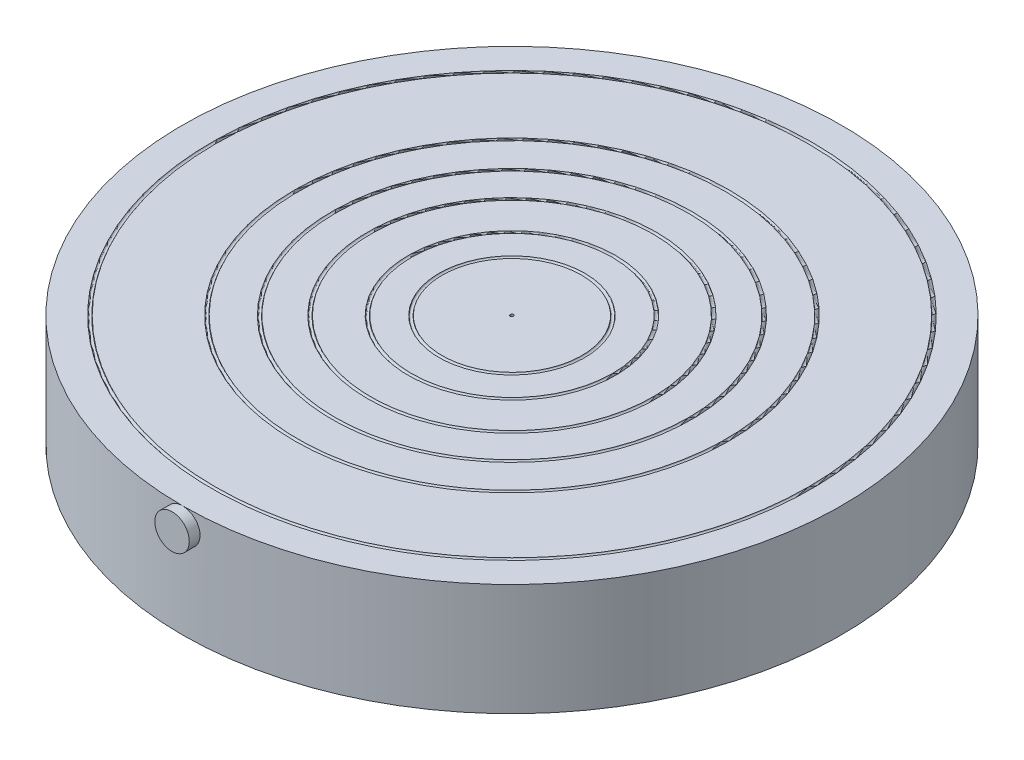
ISO-10303-21;
HEADER;
FILE_DESCRIPTION(('STEP AP214'),'2;1');
FILE_NAME('part.step','',(''),(''),'','','');
FILE_SCHEMA(('AUTOMOTIVE_DESIGN { 1 0 10303 214 1 1 1 1 }'));
ENDSEC;
DATA;
#1=APPLICATION_CONTEXT('core data for automotive mechanical design processes');
#2=APPLICATION_PROTOCOL_DEFINITION('international standard','automotive_design',2000,#1);
#3=PRODUCT_CONTEXT('',#1,'mechanical');
#4=PRODUCT('Part','Part','',(#3));
#5=PRODUCT_RELATED_PRODUCT_CATEGORY('part','',(#4));
#6=PRODUCT_DEFINITION_FORMATION('','',#4);
#7=PRODUCT_DEFINITION_CONTEXT('part definition',#1,'design');
#8=PRODUCT_DEFINITION('design','',#6,#7);
#9=PRODUCT_DEFINITION_SHAPE('','',#8);
#10=(LENGTH_UNIT() NAMED_UNIT(*) SI_UNIT(.MILLI.,.METRE.));
#11=(NAMED_UNIT(*) PLANE_ANGLE_UNIT() SI_UNIT($,.RADIAN.));
#12=(NAMED_UNIT(*) SI_UNIT($,.STERADIAN.) SOLID_ANGLE_UNIT());
#13=UNCERTAINTY_MEASURE_WITH_UNIT(LENGTH_MEASURE(1.E-05),#10,'distance_accuracy_value','');
#14=(GEOMETRIC_REPRESENTATION_CONTEXT(3) GLOBAL_UNCERTAINTY_ASSIGNED_CONTEXT((#13)) GLOBAL_UNIT_ASSIGNED_CONTEXT((#10,
#11,#12)) REPRESENTATION_CONTEXT('',''));
#15=CARTESIAN_POINT('',(0.,0.,0.));
#16=DIRECTION('',(0.,0.,1.));
#17=DIRECTION('',(1.,0.,0.));
#18=AXIS2_PLACEMENT_3D('',#15,#16,#17);
#19=CARTESIAN_POINT('',(0.,34.5,0.));
#20=DIRECTION('',(0.,1.,0.));
#21=DIRECTION('',(0.,0.,1.));
#22=AXIS2_PLACEMENT_3D('',#19,#20,#21);
#23=PLANE('',#22);
#24=CARTESIAN_POINT('',(0.,34.5,0.));
#25=DIRECTION('',(0.,-1.,0.));
#26=DIRECTION('',(0.,0.,-1.));
#27=AXIS2_PLACEMENT_3D('',#24,#25,#26);
#28=CIRCLE('',#27,92.5);
#29=CARTESIAN_POINT('',(0.,34.5,-92.5));
#30=VERTEX_POINT('',#29);
#31=EDGE_CURVE('E275',#30,#30,#28,.T.);
#32=ORIENTED_EDGE('',*,*,#31,.T.);
#33=EDGE_LOOP('',(#32));
#34=FACE_BOUND('',#33,.T.);
#35=CARTESIAN_POINT('',(0.,34.5,0.));
#36=DIRECTION('',(0.,1.,0.));
#37=DIRECTION('',(0.,0.,1.));
#38=AXIS2_PLACEMENT_3D('',#35,#36,#37);
#39=CIRCLE('',#38,101.6);
#40=CARTESIAN_POINT('',(0.,34.5,101.6));
#41=VERTEX_POINT('',#40);
#42=EDGE_CURVE('E11',#41,#41,#39,.T.);
#43=ORIENTED_EDGE('',*,*,#42,.T.);
#44=EDGE_LOOP('',(#43));
#45=FACE_BOUND('',#44,.T.);
#46=ADVANCED_FACE('F32',(#34,#45),#23,.T.);
#47=CARTESIAN_POINT('',(0.,34.5,0.));
#48=DIRECTION('',(0.,-1.,0.));
#49=DIRECTION('',(0.,0.,-1.));
#50=AXIS2_PLACEMENT_3D('',#47,#48,#49);
#51=CYLINDRICAL_SURFACE('',#50,101.6);
#52=ORIENTED_EDGE('',*,*,#42,.F.);
#53=CARTESIAN_POINT('',(5.315,29.185,101.4608829796));
#54=CARTESIAN_POINT('',(5.31500117460274,29.3342167806121,101.460882808786));
#55=CARTESIAN_POINT('',(5.30871365978366,29.4834146745144,101.461212844369));
#56=CARTESIAN_POINT('',(5.28360823993611,29.7807982593757,101.462523364034));
#57=CARTESIAN_POINT('',(5.26478711786834,29.9289836805925,101.463504015111));
#58=CARTESIAN_POINT('',(5.21472304127821,30.2233650072386,101.466089358601));
#59=CARTESIAN_POINT('',(5.18346934009149,30.3695590779852,101.467694590873));
#60=CARTESIAN_POINT('',(5.10875098915978,30.6588428285282,101.471483984128));
#61=CARTESIAN_POINT('',(5.06528187558347,30.8019313528474,101.473668356727));
#62=CARTESIAN_POINT('',(4.96649225757406,31.0838058042866,101.478551408782));
#63=CARTESIAN_POINT('',(4.91118223375217,31.2225954129035,101.481249633187));
#64=CARTESIAN_POINT('',(4.78906012485393,31.4950704191557,101.487086070157));
#65=CARTESIAN_POINT('',(4.72224380608266,31.6287539158181,101.490224444595));
#66=CARTESIAN_POINT('',(4.57764287683913,31.8899359848127,101.496849300762));
#67=CARTESIAN_POINT('',(4.49986492744555,32.0174382505319,101.500335570711));
#68=CARTESIAN_POINT('',(4.33383162273976,32.2654887118341,101.507560347797));
#69=CARTESIAN_POINT('',(4.24557240710743,32.386034320793,101.51129894765));
#70=CARTESIAN_POINT('',(4.05917015116226,32.6193368857534,101.518923558853));
#71=CARTESIAN_POINT('',(3.96102129626366,32.7320891932539,101.522809656077));
#72=CARTESIAN_POINT('',(3.75554099591389,32.9489686230952,101.530618451875));
#73=CARTESIAN_POINT('',(3.64820617216047,33.053092544245,101.534541163438));
#74=CARTESIAN_POINT('',(3.42518241038206,33.2518979385985,101.542309250511));
#75=CARTESIAN_POINT('',(3.30949622262154,33.346582496129,101.546154650953));
#76=CARTESIAN_POINT('',(3.07051384060831,33.5259095853949,101.553661871845));
#77=CARTESIAN_POINT('',(2.94721485287038,33.6105483971919,101.557323624002));
#78=CARTESIAN_POINT('',(2.69389445109261,33.7691566934901,101.564358837077));
#79=CARTESIAN_POINT('',(2.56387177481393,33.8431241647091,101.567732243547));
#80=CARTESIAN_POINT('',(2.29800252040815,33.9798689244355,101.57409549841));
#81=CARTESIAN_POINT('',(2.1621538079653,34.0426420678044,101.57708520461));
#82=CARTESIAN_POINT('',(1.88568090547316,34.1564949311911,101.582593457694));
#83=CARTESIAN_POINT('',(1.74505852980948,34.2075790381072,101.585112181274));
#84=CARTESIAN_POINT('',(1.45999034808475,34.2977335727266,101.589609823563));
#85=CARTESIAN_POINT('',(1.31554315114847,34.3367995630941,101.591588542861));
#86=CARTESIAN_POINT('',(0.8783716662121,34.4353949342708,101.596618353155));
#87=CARTESIAN_POINT('',(0.581257625320794,34.4765516413703,101.598774599003));
#88=CARTESIAN_POINT('',(-0.0155079816728562,34.5083825241574,101.600437819102));
#89=CARTESIAN_POINT('',(-0.315159526330909,34.4990571260418,101.599944815721));
#90=CARTESIAN_POINT('',(-0.908382479717474,34.4302915827626,101.596371452883));
#91=CARTESIAN_POINT('',(-1.20195955152169,34.3709004889885,101.593293625895));
#92=CARTESIAN_POINT('',(-1.77495976790941,34.2037480285153,101.584898981917));
#93=CARTESIAN_POINT('',(-2.05438284901855,34.0959864449173,101.579582154888));
#94=CARTESIAN_POINT('',(-2.59131531867501,33.8351007605325,101.567304330305));
#95=CARTESIAN_POINT('',(-2.84881383736103,33.6819543252808,101.560342523578));
#96=CARTESIAN_POINT('',(-3.33446515521756,33.3346612496128,101.545558574705));
#97=CARTESIAN_POINT('',(-3.56261772641812,33.1405142907206,101.537736425876));
#98=CARTESIAN_POINT('',(-3.98338794274128,32.7164542924386,101.522101549927));
#99=CARTESIAN_POINT('',(-4.1759626873944,32.4864986817894,101.514288845323));
#100=CARTESIAN_POINT('',(-4.51977995110387,31.9974983712851,101.499563046743));
#101=CARTESIAN_POINT('',(-4.67102245837605,31.7384536631363,101.492649953024));
#102=CARTESIAN_POINT('',(-4.92787847100622,31.1986023851235,101.480503692856));
#103=CARTESIAN_POINT('',(-5.03349033057504,30.9177950307632,101.475270587003));
#104=CARTESIAN_POINT('',(-5.19605827849382,30.3424013734151,101.467076732095));
#105=CARTESIAN_POINT('',(-5.25301476743279,30.0478151838922,101.464115964333));
#106=CARTESIAN_POINT('',(-5.31660206990319,29.4535998753316,101.460804141258));
#107=CARTESIAN_POINT('',(-5.3232924429259,29.1539771462362,101.46044999741));
#108=CARTESIAN_POINT('',(-5.2863130507309,28.5578653733906,101.462383294983));
#109=CARTESIAN_POINT('',(-5.24264346809655,28.261376318283,101.464670726827));
#110=CARTESIAN_POINT('',(-5.10623321542468,27.6801156180239,101.471626547579));
#111=CARTESIAN_POINT('',(-5.01351983502648,27.3953375513601,101.476293612326));
#112=CARTESIAN_POINT('',(-4.78168132513445,26.8453847597459,101.48748156528));
#113=CARTESIAN_POINT('',(-4.64255590131643,26.5802101591248,101.494002465244));
#114=CARTESIAN_POINT('',(-4.32169010042815,26.0767176638132,101.508170659726));
#115=CARTESIAN_POINT('',(-4.13990973266516,25.8384252846254,101.515819008754));
#116=CARTESIAN_POINT('',(-3.73895144560112,25.3957183173243,101.531376358734));
#117=CARTESIAN_POINT('',(-3.51977326587322,25.1913039651468,101.539285361501));
#118=CARTESIAN_POINT('',(-3.04998908914459,24.8219548821468,101.554481707955));
#119=CARTESIAN_POINT('',(-2.79935281686367,24.6570586344173,101.561768441263));
#120=CARTESIAN_POINT('',(-2.2739051746674,24.371691269821,101.574890124794));
#121=CARTESIAN_POINT('',(-1.99909391741149,24.2512199459404,101.580725081783));
#122=CARTESIAN_POINT('',(-1.43329543429735,24.0581834860734,101.590283438989));
#123=CARTESIAN_POINT('',(-1.14231658874445,23.9855937777213,101.594007922141));
#124=CARTESIAN_POINT('',(-0.552118704059833,23.890322696777,101.598927213521));
#125=CARTESIAN_POINT('',(-0.252899717247897,23.8676410073737,101.600122037808));
#126=CARTESIAN_POINT('',(0.195124012424332,23.8714752782704,101.599923508061));
#127=CARTESIAN_POINT('',(0.344322150511061,23.8790612361651,101.599525621187));
#128=CARTESIAN_POINT('',(0.641533930320362,23.9067530220316,101.598082848607));
#129=CARTESIAN_POINT('',(0.789547989444175,23.9268542217109,101.597038202081));
#130=CARTESIAN_POINT('',(1.0833979750057,23.979447893396,101.594329905519));
#131=CARTESIAN_POINT('',(1.22923307521458,24.0119449477269,101.592666026579));
#132=CARTESIAN_POINT('',(1.5175935850625,24.0890802590286,101.58876753295));
#133=CARTESIAN_POINT('',(1.66012019293641,24.1337140435665,101.586533128521));
#134=CARTESIAN_POINT('',(1.94095705819782,24.2348289308114,101.581555513956));
#135=CARTESIAN_POINT('',(2.07926572639756,24.2913144372281,101.578812114738));
#136=CARTESIAN_POINT('',(2.35058177667887,24.4156968376036,101.572895855195));
#137=CARTESIAN_POINT('',(2.48359109021574,24.4835895260369,101.569723153224));
#138=CARTESIAN_POINT('',(2.7434648329491,24.6303429299847,101.563036111319));
#139=CARTESIAN_POINT('',(2.87032717799128,24.7092073308997,101.55952165671));
#140=CARTESIAN_POINT('',(3.11691634962626,24.877295931242,101.552252780278));
#141=CARTESIAN_POINT('',(3.23664578013213,24.9665163146507,101.548498447075));
#142=CARTESIAN_POINT('',(3.46834250267803,25.1548454841534,101.540849210958));
#143=CARTESIAN_POINT('',(3.58029825262336,25.2539684627146,101.536954111547));
#144=CARTESIAN_POINT('',(3.7954231193791,25.4612530136738,101.5291403854));
#145=CARTESIAN_POINT('',(3.89859545327594,25.5694112477363,101.525221767844));
#146=CARTESIAN_POINT('',(4.09552945979815,25.7941012669056,101.517468243125));
#147=CARTESIAN_POINT('',(4.18928530474448,25.9106381617885,101.513633388936));
#148=CARTESIAN_POINT('',(4.36661554458716,26.1511560188566,101.506160130457));
#149=CARTESIAN_POINT('',(4.45019368157919,26.275134219872,101.50252165424));
#150=CARTESIAN_POINT('',(4.60672268670029,26.5298710865695,101.495538104759));
#151=CARTESIAN_POINT('',(4.679658758648,26.6606388562197,101.49219344252));
#152=CARTESIAN_POINT('',(4.81422057303797,26.9278179579667,101.485899600144));
#153=CARTESIAN_POINT('',(4.87585044581773,27.0642272067339,101.482950275691));
#154=CARTESIAN_POINT('',(4.98734376502482,27.3416461580247,101.47753208654));
#155=CARTESIAN_POINT('',(5.03721743061969,27.4826517428612,101.47506280489));
#156=CARTESIAN_POINT('',(5.12489794715072,27.768324203476,101.47067233397));
#157=CARTESIAN_POINT('',(5.16270791246221,27.9129901238731,101.468751003254));
#158=CARTESIAN_POINT('',(5.23441349541468,28.2437922206541,101.46508045055));
#159=CARTESIAN_POINT('',(5.26460688720577,28.4307445528914,101.463512245829));
#160=CARTESIAN_POINT('',(5.30489938581043,28.8068080334634,101.461413619068));
#161=CARTESIAN_POINT('',(5.31499851159603,28.9959191797596,101.460883196047));
#162=CARTESIAN_POINT('',(5.315,29.185,101.4608829796));
#163=B_SPLINE_CURVE_WITH_KNOTS('',3,(#53,#54,#55,#56,#57,#58,#59,#60,#61,#62,#63,#64,#65,#66,
#67,#68,#69,#70,#71,#72,#73,#74,#75,#76,#77,#78,#79,#80,#81,#82,#83,#84,#85,#86,#87,#88,#89,#90,
#91,#92,#93,#94,#95,#96,#97,#98,#99,#100,#101,#102,#103,#104,#105,#106,#107,#108,#109,#110,#111,
#112,#113,#114,#115,#116,#117,#118,#119,#120,#121,#122,#123,#124,#125,#126,#127,#128,#129,#130,
#131,#132,#133,#134,#135,#136,#137,#138,#139,#140,#141,#142,#143,#144,#145,#146,#147,#148,#149,
#150,#151,#152,#153,#154,#155,#156,#157,#158,#159,#160,#161,#162),.UNSPECIFIED.,.T.,.F.,(4,2,2,
2,2,2,2,2,2,2,2,2,2,2,2,2,2,2,2,2,2,2,2,2,2,2,2,2,2,2,2,2,2,2,2,2,2,2,2,2,2,2,2,2,2,2,2,2,2,2,2,
2,2,2,4),(0.,0.447485133010546,0.895085167691261,1.34307294945596,1.79122465103718,
2.23898131317411,2.6869030789657,3.13455381942442,3.5823699469704,4.0304509203397,
4.47869739742562,4.92679692588843,5.37506187124983,5.82341127712462,6.27192635875413,
6.72027283546722,7.16878465279391,8.06401520270638,8.95923819461446,9.85358511830968,
10.7479360523993,11.6427278409346,12.5375265801167,13.4333973423139,14.329268359931,
15.225171686793,16.1210676374396,17.015901888095,17.9107328944795,18.8050665093619,
19.6994057958116,20.5945869345742,21.489774307357,22.3858299114711,23.2818813400387,
24.1774725654792,25.0730581057818,25.5207968358275,25.9683700847768,26.4161089469019,
26.8636830385654,27.3114237294716,27.7589997110212,28.206726398074,28.6542886254477,
29.1025017641104,29.5505500238331,29.9988738849105,30.4470324072972,30.8958082073091,
31.3444197343633,31.7926398526056,32.2407441641508,32.8077778150145,33.3748109305122),.UNSPECIFIED.);
#164=EDGE_CURVE('E43',#41,#41,#163,.T.);
#165=ORIENTED_EDGE('',*,*,#164,.F.);
#166=EDGE_LOOP('',(#52,#165));
#167=FACE_BOUND('',#166,.T.);
#168=CARTESIAN_POINT('',(0.,0.,0.));
#169=DIRECTION('',(0.,1.,0.));
#170=DIRECTION('',(0.,0.,1.));
#171=AXIS2_PLACEMENT_3D('',#168,#169,#170);
#172=CIRCLE('',#171,101.6);
#173=CARTESIAN_POINT('',(0.,0.,101.6));
#174=VERTEX_POINT('',#173);
#175=EDGE_CURVE('E36',#174,#174,#172,.T.);
#176=ORIENTED_EDGE('',*,*,#175,.T.);
#177=EDGE_LOOP('',(#176));
#178=FACE_BOUND('',#177,.T.);
#179=ADVANCED_FACE('F34',(#167,#178),#51,.T.);
#180=CARTESIAN_POINT('',(0.,0.,0.));
#181=DIRECTION('',(0.,1.,0.));
#182=DIRECTION('',(0.,0.,1.));
#183=AXIS2_PLACEMENT_3D('',#180,#181,#182);
#184=PLANE('',#183);
#185=ORIENTED_EDGE('',*,*,#175,.F.);
#186=EDGE_LOOP('',(#185));
#187=FACE_BOUND('',#186,.T.);
#188=ADVANCED_FACE('F82',(#187),#184,.F.);
#189=CARTESIAN_POINT('',(0.,34.5,0.));
#190=DIRECTION('',(0.,-1.,0.));
#191=DIRECTION('',(0.,0.,-1.));
#192=AXIS2_PLACEMENT_3D('',#189,#190,#191);
#193=TOROIDAL_SURFACE('',#192,92.,0.5);
#194=ORIENTED_EDGE('',*,*,#31,.F.);
#195=EDGE_LOOP('',(#194));
#196=FACE_BOUND('',#195,.T.);
#197=CARTESIAN_POINT('',(0.,34.5,0.));
#198=DIRECTION('',(0.,-1.,0.));
#199=DIRECTION('',(0.,0.,-1.));
#200=AXIS2_PLACEMENT_3D('',#197,#198,#199);
#201=CIRCLE('',#200,91.5);
#202=CARTESIAN_POINT('',(0.,34.5,-91.5));
#203=VERTEX_POINT('',#202);
#204=EDGE_CURVE('E278',#203,#203,#201,.T.);
#205=ORIENTED_EDGE('',*,*,#204,.T.);
#206=EDGE_LOOP('',(#205));
#207=FACE_BOUND('',#206,.T.);
#208=ADVANCED_FACE('F92',(#196,#207),#193,.F.);
#209=CARTESIAN_POINT('',(0.,34.5,0.));
#210=DIRECTION('',(0.,-1.,0.));
#211=DIRECTION('',(0.,0.,-1.));
#212=AXIS2_PLACEMENT_3D('',#209,#210,#211);
#213=CIRCLE('',#212,67.);
#214=CARTESIAN_POINT('',(0.,34.5,-67.));
#215=VERTEX_POINT('',#214);
#216=EDGE_CURVE('E281',#215,#215,#213,.T.);
#217=ORIENTED_EDGE('',*,*,#216,.T.);
#218=EDGE_LOOP('',(#217));
#219=FACE_BOUND('',#218,.T.);
#220=ORIENTED_EDGE('',*,*,#204,.F.);
#221=EDGE_LOOP('',(#220));
#222=FACE_BOUND('',#221,.T.);
#223=ADVANCED_FACE('F78',(#219,#222),#23,.T.);
#224=CARTESIAN_POINT('',(0.,34.5,0.));
#225=DIRECTION('',(0.,-1.,0.));
#226=DIRECTION('',(0.,0.,-1.));
#227=AXIS2_PLACEMENT_3D('',#224,#225,#226);
#228=TOROIDAL_SURFACE('',#227,66.5,0.5);
#229=ORIENTED_EDGE('',*,*,#216,.F.);
#230=EDGE_LOOP('',(#229));
#231=FACE_BOUND('',#230,.T.);
#232=CARTESIAN_POINT('',(0.,34.5,0.));
#233=DIRECTION('',(0.,-1.,0.));
#234=DIRECTION('',(0.,0.,-1.));
#235=AXIS2_PLACEMENT_3D('',#232,#233,#234);
#236=CIRCLE('',#235,66.);
#237=CARTESIAN_POINT('',(0.,34.5,-66.));
#238=VERTEX_POINT('',#237);
#239=EDGE_CURVE('E283',#238,#238,#236,.T.);
#240=ORIENTED_EDGE('',*,*,#239,.T.);
#241=EDGE_LOOP('',(#240));
#242=FACE_BOUND('',#241,.T.);
#243=ADVANCED_FACE('F91',(#231,#242),#228,.F.);
#244=CARTESIAN_POINT('',(0.,34.5,0.));
#245=DIRECTION('',(0.,-1.,0.));
#246=DIRECTION('',(0.,0.,-1.));
#247=AXIS2_PLACEMENT_3D('',#244,#245,#246);
#248=CIRCLE('',#247,55.5);
#249=CARTESIAN_POINT('',(0.,34.5,-55.5));
#250=VERTEX_POINT('',#249);
#251=EDGE_CURVE('E286',#250,#250,#248,.T.);
#252=ORIENTED_EDGE('',*,*,#251,.T.);
#253=EDGE_LOOP('',(#252));
#254=FACE_BOUND('',#253,.T.);
#255=ORIENTED_EDGE('',*,*,#239,.F.);
#256=EDGE_LOOP('',(#255));
#257=FACE_BOUND('',#256,.T.);
#258=ADVANCED_FACE('F94',(#254,#257),#23,.T.);
#259=CARTESIAN_POINT('',(0.,34.5,0.));
#260=DIRECTION('',(0.,-1.,0.));
#261=DIRECTION('',(0.,0.,-1.));
#262=AXIS2_PLACEMENT_3D('',#259,#260,#261);
#263=TOROIDAL_SURFACE('',#262,55.,0.5);
#264=ORIENTED_EDGE('',*,*,#251,.F.);
#265=EDGE_LOOP('',(#264));
#266=FACE_BOUND('',#265,.T.);
#267=CARTESIAN_POINT('',(0.,34.5,0.));
#268=DIRECTION('',(0.,-1.,0.));
#269=DIRECTION('',(0.,0.,-1.));
#270=AXIS2_PLACEMENT_3D('',#267,#268,#269);
#271=CIRCLE('',#270,54.5);
#272=CARTESIAN_POINT('',(0.,34.5,-54.5));
#273=VERTEX_POINT('',#272);
#274=EDGE_CURVE('E288',#273,#273,#271,.T.);
#275=ORIENTED_EDGE('',*,*,#274,.T.);
#276=EDGE_LOOP('',(#275));
#277=FACE_BOUND('',#276,.T.);
#278=ADVANCED_FACE('F106',(#266,#277),#263,.F.);
#279=CARTESIAN_POINT('',(0.,34.5,0.));
#280=DIRECTION('',(0.,-1.,0.));
#281=DIRECTION('',(0.,0.,-1.));
#282=AXIS2_PLACEMENT_3D('',#279,#280,#281);
#283=CIRCLE('',#282,44.5);
#284=CARTESIAN_POINT('',(0.,34.5,-44.5));
#285=VERTEX_POINT('',#284);
#286=EDGE_CURVE('E291',#285,#285,#283,.T.);
#287=ORIENTED_EDGE('',*,*,#286,.T.);
#288=EDGE_LOOP('',(#287));
#289=FACE_BOUND('',#288,.T.);
#290=ORIENTED_EDGE('',*,*,#274,.F.);
#291=EDGE_LOOP('',(#290));
#292=FACE_BOUND('',#291,.T.);
#293=ADVANCED_FACE('F108',(#289,#292),#23,.T.);
#294=CARTESIAN_POINT('',(0.,34.5,0.));
#295=DIRECTION('',(0.,-1.,0.));
#296=DIRECTION('',(0.,0.,-1.));
#297=AXIS2_PLACEMENT_3D('',#294,#295,#296);
#298=TOROIDAL_SURFACE('',#297,44.,0.5);
#299=ORIENTED_EDGE('',*,*,#286,.F.);
#300=EDGE_LOOP('',(#299));
#301=FACE_BOUND('',#300,.T.);
#302=CARTESIAN_POINT('',(0.,34.5,0.));
#303=DIRECTION('',(0.,-1.,0.));
#304=DIRECTION('',(0.,0.,-1.));
#305=AXIS2_PLACEMENT_3D('',#302,#303,#304);
#306=CIRCLE('',#305,43.5);
#307=CARTESIAN_POINT('',(0.,34.5,-43.5));
#308=VERTEX_POINT('',#307);
#309=EDGE_CURVE('E155',#308,#308,#306,.T.);
#310=ORIENTED_EDGE('',*,*,#309,.T.);
#311=EDGE_LOOP('',(#310));
#312=FACE_BOUND('',#311,.T.);
#313=ADVANCED_FACE('F117',(#301,#312),#298,.F.);
#314=CARTESIAN_POINT('',(0.,34.5,0.));
#315=DIRECTION('',(0.,-1.,0.));
#316=DIRECTION('',(0.,0.,-1.));
#317=AXIS2_PLACEMENT_3D('',#314,#315,#316);
#318=CIRCLE('',#317,32.);
#319=CARTESIAN_POINT('',(0.,34.5,-32.));
#320=VERTEX_POINT('',#319);
#321=EDGE_CURVE('E151',#320,#320,#318,.T.);
#322=ORIENTED_EDGE('',*,*,#321,.T.);
#323=EDGE_LOOP('',(#322));
#324=FACE_BOUND('',#323,.T.);
#325=ORIENTED_EDGE('',*,*,#309,.F.);
#326=EDGE_LOOP('',(#325));
#327=FACE_BOUND('',#326,.T.);
#328=ADVANCED_FACE('F119',(#324,#327),#23,.T.);
#329=CARTESIAN_POINT('',(0.,34.5,0.));
#330=DIRECTION('',(0.,-1.,0.));
#331=DIRECTION('',(0.,0.,-1.));
#332=AXIS2_PLACEMENT_3D('',#329,#330,#331);
#333=TOROIDAL_SURFACE('',#332,31.5,0.5);
#334=ORIENTED_EDGE('',*,*,#321,.F.);
#335=EDGE_LOOP('',(#334));
#336=FACE_BOUND('',#335,.T.);
#337=CARTESIAN_POINT('',(0.,34.5,0.));
#338=DIRECTION('',(0.,-1.,0.));
#339=DIRECTION('',(0.,0.,-1.));
#340=AXIS2_PLACEMENT_3D('',#337,#338,#339);
#341=CIRCLE('',#340,31.);
#342=CARTESIAN_POINT('',(0.,34.5,-31.));
#343=VERTEX_POINT('',#342);
#344=EDGE_CURVE('E149',#343,#343,#341,.T.);
#345=ORIENTED_EDGE('',*,*,#344,.T.);
#346=EDGE_LOOP('',(#345));
#347=FACE_BOUND('',#346,.T.);
#348=ADVANCED_FACE('F128',(#336,#347),#333,.F.);
#349=CARTESIAN_POINT('',(0.,34.5,0.));
#350=DIRECTION('',(0.,-1.,0.));
#351=DIRECTION('',(0.,0.,-1.));
#352=AXIS2_PLACEMENT_3D('',#349,#350,#351);
#353=CIRCLE('',#352,22.5);
#354=CARTESIAN_POINT('',(0.,34.5,-22.5));
#355=VERTEX_POINT('',#354);
#356=EDGE_CURVE('E146',#355,#355,#353,.T.);
#357=ORIENTED_EDGE('',*,*,#356,.T.);
#358=EDGE_LOOP('',(#357));
#359=FACE_BOUND('',#358,.T.);
#360=ORIENTED_EDGE('',*,*,#344,.F.);
#361=EDGE_LOOP('',(#360));
#362=FACE_BOUND('',#361,.T.);
#363=ADVANCED_FACE('F89',(#359,#362),#23,.T.);
#364=CARTESIAN_POINT('',(0.,34.5,0.));
#365=DIRECTION('',(0.,-1.,0.));
#366=DIRECTION('',(0.,0.,-1.));
#367=AXIS2_PLACEMENT_3D('',#364,#365,#366);
#368=TOROIDAL_SURFACE('',#367,22.,0.5);
#369=ORIENTED_EDGE('',*,*,#356,.F.);
#370=EDGE_LOOP('',(#369));
#371=FACE_BOUND('',#370,.T.);
#372=CARTESIAN_POINT('',(0.,34.5,0.));
#373=DIRECTION('',(0.,-1.,0.));
#374=DIRECTION('',(0.,0.,-1.));
#375=AXIS2_PLACEMENT_3D('',#372,#373,#374);
#376=CIRCLE('',#375,21.5);
#377=CARTESIAN_POINT('',(0.,34.5,-21.5));
#378=VERTEX_POINT('',#377);
#379=EDGE_CURVE('E153',#378,#378,#376,.T.);
#380=ORIENTED_EDGE('',*,*,#379,.T.);
#381=EDGE_LOOP('',(#380));
#382=FACE_BOUND('',#381,.T.);
#383=ADVANCED_FACE('F87',(#371,#382),#368,.F.);
#384=CARTESIAN_POINT('',(0.,34.5,0.));
#385=DIRECTION('',(0.,1.,0.));
#386=DIRECTION('',(0.,0.,1.));
#387=AXIS2_PLACEMENT_3D('',#384,#385,#386);
#388=CIRCLE('',#387,0.5);
#389=CARTESIAN_POINT('',(0.,34.5,0.5));
#390=VERTEX_POINT('',#389);
#391=EDGE_CURVE('E50',#390,#390,#388,.T.);
#392=ORIENTED_EDGE('',*,*,#391,.F.);
#393=EDGE_LOOP('',(#392));
#394=FACE_BOUND('',#393,.T.);
#395=ORIENTED_EDGE('',*,*,#379,.F.);
#396=EDGE_LOOP('',(#395));
#397=FACE_BOUND('',#396,.T.);
#398=ADVANCED_FACE('F77',(#394,#397),#23,.T.);
#399=CARTESIAN_POINT('',(0.,33.5,0.));
#400=DIRECTION('',(0.,1.,0.));
#401=DIRECTION('',(0.,0.,1.));
#402=AXIS2_PLACEMENT_3D('',#399,#400,#401);
#403=CYLINDRICAL_SURFACE('',#402,0.5);
#404=CARTESIAN_POINT('',(0.,33.5,0.));
#405=DIRECTION('',(0.,1.,0.));
#406=DIRECTION('',(0.,0.,1.));
#407=AXIS2_PLACEMENT_3D('',#404,#405,#406);
#408=CIRCLE('',#407,0.5);
#409=CARTESIAN_POINT('',(0.,33.5,0.5));
#410=VERTEX_POINT('',#409);
#411=EDGE_CURVE('E57',#410,#410,#408,.T.);
#412=ORIENTED_EDGE('',*,*,#411,.F.);
#413=EDGE_LOOP('',(#412));
#414=FACE_BOUND('',#413,.T.);
#415=ORIENTED_EDGE('',*,*,#391,.T.);
#416=EDGE_LOOP('',(#415));
#417=FACE_BOUND('',#416,.T.);
#418=ADVANCED_FACE('F72',(#414,#417),#403,.F.);
#419=CARTESIAN_POINT('',(0.,33.5,0.));
#420=DIRECTION('',(0.,1.,0.));
#421=DIRECTION('',(0.,0.,1.));
#422=AXIS2_PLACEMENT_3D('',#419,#420,#421);
#423=PLANE('',#422);
#424=ORIENTED_EDGE('',*,*,#411,.T.);
#425=EDGE_LOOP('',(#424));
#426=FACE_BOUND('',#425,.T.);
#427=ADVANCED_FACE('F65',(#426),#423,.T.);
#428=CARTESIAN_POINT('',(0.,29.185,104.78));
#429=DIRECTION('',(0.,0.,1.));
#430=DIRECTION('',(1.,0.,0.));
#431=AXIS2_PLACEMENT_3D('',#428,#429,#430);
#432=PLANE('',#431);
#433=CARTESIAN_POINT('',(0.,29.185,104.78));
#434=DIRECTION('',(0.,0.,1.));
#435=DIRECTION('',(1.,0.,0.));
#436=AXIS2_PLACEMENT_3D('',#433,#434,#435);
#437=CIRCLE('',#436,5.315);
#438=CARTESIAN_POINT('',(5.315,29.185,104.78));
#439=VERTEX_POINT('',#438);
#440=EDGE_CURVE('E47',#439,#439,#437,.T.);
#441=ORIENTED_EDGE('',*,*,#440,.T.);
#442=EDGE_LOOP('',(#441));
#443=FACE_BOUND('',#442,.T.);
#444=ADVANCED_FACE('F63',(#443),#432,.T.);
#445=CARTESIAN_POINT('',(0.,29.185,-500000.));
#446=DIRECTION('',(0.,0.,1.));
#447=DIRECTION('',(1.,0.,0.));
#448=AXIS2_PLACEMENT_3D('',#445,#446,#447);
#449=CYLINDRICAL_SURFACE('',#448,5.315);
#450=ORIENTED_EDGE('',*,*,#440,.F.);
#451=EDGE_LOOP('',(#450));
#452=FACE_BOUND('',#451,.T.);
#453=ORIENTED_EDGE('',*,*,#164,.T.);
#454=EDGE_LOOP('',(#453));
#455=FACE_BOUND('',#454,.T.);
#456=ADVANCED_FACE('F44',(#452,#455),#449,.T.);
#457=CLOSED_SHELL('',(#46,#179,#188,#208,#223,#243,#258,#278,#293,#313,#328,#348,#363,#383,#398,
#418,#427,#444,#456));
#458=MANIFOLD_SOLID_BREP('B2',#457);
#459=ADVANCED_BREP_SHAPE_REPRESENTATION('',(#18,#458),#14);
#460=SHAPE_DEFINITION_REPRESENTATION(#9,#459);
ENDSEC;
END-ISO-10303-21;
